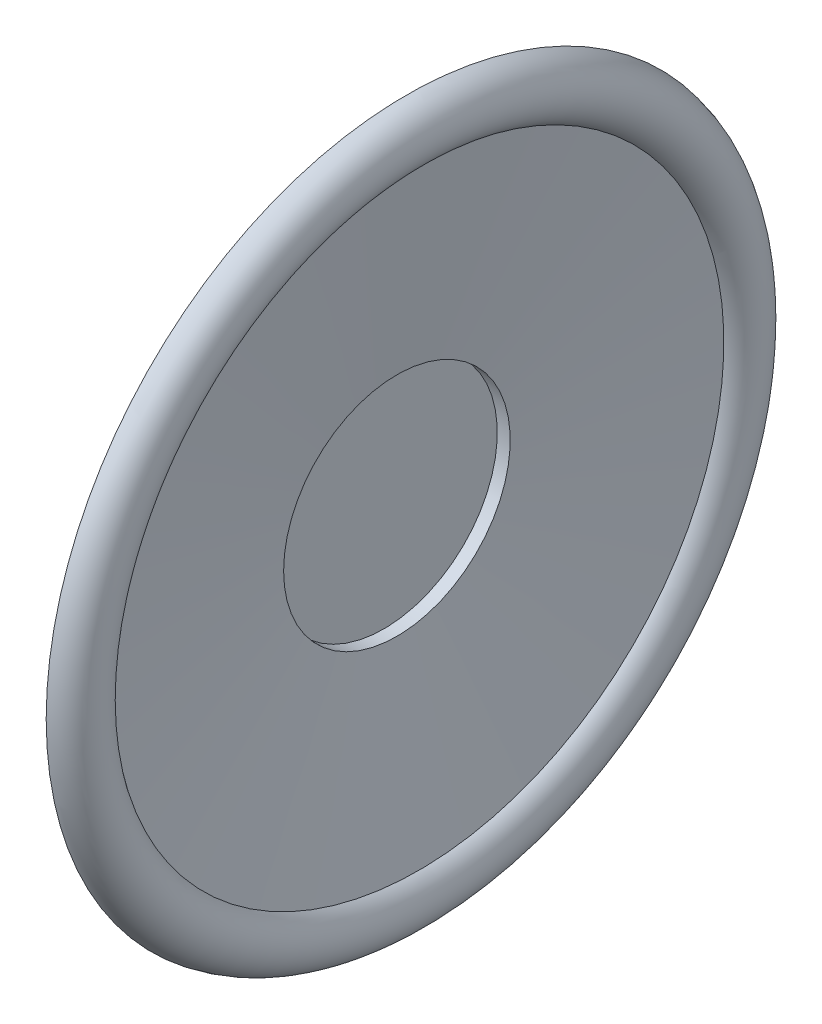
ISO-10303-21;
HEADER;
FILE_DESCRIPTION(('STEP AP214'),'2;1');
FILE_NAME('part.step','',(''),(''),'','','');
FILE_SCHEMA(('AUTOMOTIVE_DESIGN { 1 0 10303 214 1 1 1 1 }'));
ENDSEC;
DATA;
#1=APPLICATION_CONTEXT('core data for automotive mechanical design processes');
#2=APPLICATION_PROTOCOL_DEFINITION('international standard','automotive_design',2000,#1);
#3=PRODUCT_CONTEXT('',#1,'mechanical');
#4=PRODUCT('Part','Part','',(#3));
#5=PRODUCT_RELATED_PRODUCT_CATEGORY('part','',(#4));
#6=PRODUCT_DEFINITION_FORMATION('','',#4);
#7=PRODUCT_DEFINITION_CONTEXT('part definition',#1,'design');
#8=PRODUCT_DEFINITION('design','',#6,#7);
#9=PRODUCT_DEFINITION_SHAPE('','',#8);
#10=(LENGTH_UNIT() NAMED_UNIT(*) SI_UNIT(.MILLI.,.METRE.));
#11=(NAMED_UNIT(*) PLANE_ANGLE_UNIT() SI_UNIT($,.RADIAN.));
#12=(NAMED_UNIT(*) SI_UNIT($,.STERADIAN.) SOLID_ANGLE_UNIT());
#13=UNCERTAINTY_MEASURE_WITH_UNIT(LENGTH_MEASURE(1.E-05),#10,'distance_accuracy_value','');
#14=(GEOMETRIC_REPRESENTATION_CONTEXT(3) GLOBAL_UNCERTAINTY_ASSIGNED_CONTEXT((#13)) GLOBAL_UNIT_ASSIGNED_CONTEXT((#10,
#11,#12)) REPRESENTATION_CONTEXT('',''));
#15=CARTESIAN_POINT('',(0.,0.,0.));
#16=DIRECTION('',(0.,0.,1.));
#17=DIRECTION('',(1.,0.,0.));
#18=AXIS2_PLACEMENT_3D('',#15,#16,#17);
#19=CARTESIAN_POINT('',(1.21052128690283,0.,7.));
#20=DIRECTION('',(-1.,0.,0.));
#21=DIRECTION('',(0.,0.,1.));
#22=AXIS2_PLACEMENT_3D('',#19,#20,#21);
#23=TOROIDAL_SURFACE('',#22,17.4911844864912,1.59453908292243);
#24=CARTESIAN_POINT('',(1.39329390693024,0.,7.));
#25=DIRECTION('',(-1.,0.,0.));
#26=DIRECTION('',(0.,0.,1.));
#27=AXIS2_PLACEMENT_3D('',#24,#25,#26);
#28=CIRCLE('',#27,19.0752138600621);
#29=CARTESIAN_POINT('',(1.39329390693024,0.,26.0752138600621));
#30=VERTEX_POINT('',#29);
#31=EDGE_CURVE('E10',#30,#30,#28,.T.);
#32=ORIENTED_EDGE('',*,*,#31,.F.);
#33=EDGE_LOOP('',(#32));
#34=FACE_BOUND('',#33,.T.);
#35=CARTESIAN_POINT('',(2.06156750117769,0.,7.));
#36=DIRECTION('',(-1.,0.,0.));
#37=DIRECTION('',(0.,0.,1.));
#38=AXIS2_PLACEMENT_3D('',#35,#36,#37);
#39=CIRCLE('',#38,16.1427501246717);
#40=CARTESIAN_POINT('',(2.06156750117769,0.,23.1427501246717));
#41=VERTEX_POINT('',#40);
#42=EDGE_CURVE('E61',#41,#41,#39,.T.);
#43=ORIENTED_EDGE('',*,*,#42,.T.);
#44=EDGE_LOOP('',(#43));
#45=FACE_BOUND('',#44,.T.);
#46=ADVANCED_FACE('F33',(#34,#45),#23,.T.);
#47=CARTESIAN_POINT('',(1.27866979894511,0.,7.));
#48=DIRECTION('',(1.,0.,0.));
#49=DIRECTION('',(0.,0.,-1.));
#50=AXIS2_PLACEMENT_3D('',#47,#48,#49);
#51=CONICAL_SURFACE('',#50,18.0818049241909,1.455919721378);
#52=ORIENTED_EDGE('',*,*,#31,.T.);
#53=EDGE_LOOP('',(#52));
#54=FACE_BOUND('',#53,.T.);
#55=CARTESIAN_POINT('',(1.27866979894511,0.,7.));
#56=DIRECTION('',(-1.,0.,0.));
#57=DIRECTION('',(0.,0.,1.));
#58=AXIS2_PLACEMENT_3D('',#55,#56,#57);
#59=CIRCLE('',#58,18.0818049241909);
#60=CARTESIAN_POINT('',(1.27866979894511,0.,25.0818049241909));
#61=VERTEX_POINT('',#60);
#62=EDGE_CURVE('E39',#61,#61,#59,.T.);
#63=ORIENTED_EDGE('',*,*,#62,.F.);
#64=EDGE_LOOP('',(#63));
#65=FACE_BOUND('',#64,.T.);
#66=ADVANCED_FACE('F89',(#54,#65),#51,.T.);
#67=CARTESIAN_POINT('',(1.21052128690283,0.,7.));
#68=DIRECTION('',(-1.,0.,0.));
#69=DIRECTION('',(0.,0.,1.));
#70=AXIS2_PLACEMENT_3D('',#67,#68,#69);
#71=TOROIDAL_SURFACE('',#70,17.4911844864912,0.594539082922428);
#72=ORIENTED_EDGE('',*,*,#62,.T.);
#73=EDGE_LOOP('',(#72));
#74=FACE_BOUND('',#73,.T.);
#75=CARTESIAN_POINT('',(1.14237277486055,0.,7.));
#76=DIRECTION('',(-1.,0.,0.));
#77=DIRECTION('',(0.,0.,1.));
#78=AXIS2_PLACEMENT_3D('',#75,#76,#77);
#79=CIRCLE('',#78,16.9005640487914);
#80=CARTESIAN_POINT('',(1.14237277486055,0.,23.9005640487914));
#81=VERTEX_POINT('',#80);
#82=EDGE_CURVE('E43',#81,#81,#79,.T.);
#83=ORIENTED_EDGE('',*,*,#82,.F.);
#84=EDGE_LOOP('',(#83));
#85=FACE_BOUND('',#84,.T.);
#86=ADVANCED_FACE('F94',(#74,#85),#71,.F.);
#87=CARTESIAN_POINT('',(0.,0.,7.));
#88=DIRECTION('',(1.,0.,0.));
#89=DIRECTION('',(0.,0.,-1.));
#90=AXIS2_PLACEMENT_3D('',#87,#88,#89);
#91=CONICAL_SURFACE('',#90,7.,1.455919721378);
#92=ORIENTED_EDGE('',*,*,#82,.T.);
#93=EDGE_LOOP('',(#92));
#94=FACE_BOUND('',#93,.T.);
#95=CARTESIAN_POINT('',(0.,0.,7.));
#96=DIRECTION('',(-1.,0.,0.));
#97=DIRECTION('',(0.,0.,1.));
#98=AXIS2_PLACEMENT_3D('',#95,#96,#97);
#99=CIRCLE('',#98,7.);
#100=CARTESIAN_POINT('',(0.,0.,14.));
#101=VERTEX_POINT('',#100);
#102=EDGE_CURVE('E47',#101,#101,#99,.T.);
#103=ORIENTED_EDGE('',*,*,#102,.F.);
#104=EDGE_LOOP('',(#103));
#105=FACE_BOUND('',#104,.T.);
#106=ADVANCED_FACE('F98',(#94,#105),#91,.T.);
#107=CARTESIAN_POINT('',(-0.794424496718019,0.,7.));
#108=DIRECTION('',(-1.,0.,0.));
#109=DIRECTION('',(0.,0.,1.));
#110=AXIS2_PLACEMENT_3D('',#107,#108,#109);
#111=CYLINDRICAL_SURFACE('',#110,7.);
#112=ORIENTED_EDGE('',*,*,#102,.T.);
#113=EDGE_LOOP('',(#112));
#114=FACE_BOUND('',#113,.T.);
#115=CARTESIAN_POINT('',(-0.79442449671802,0.,7.));
#116=DIRECTION('',(-1.,0.,0.));
#117=DIRECTION('',(0.,0.,1.));
#118=AXIS2_PLACEMENT_3D('',#115,#116,#117);
#119=CIRCLE('',#118,7.);
#120=CARTESIAN_POINT('',(-0.79442449671802,0.,14.));
#121=VERTEX_POINT('',#120);
#122=EDGE_CURVE('E52',#121,#121,#119,.T.);
#123=ORIENTED_EDGE('',*,*,#122,.F.);
#124=EDGE_LOOP('',(#123));
#125=FACE_BOUND('',#124,.T.);
#126=ADVANCED_FACE('F85',(#114,#125),#111,.T.);
#127=CARTESIAN_POINT('',(-0.79442449671802,0.,0.));
#128=DIRECTION('',(-1.,0.,0.));
#129=DIRECTION('',(0.,0.,1.));
#130=AXIS2_PLACEMENT_3D('',#127,#128,#129);
#131=PLANE('',#130);
#132=ORIENTED_EDGE('',*,*,#122,.T.);
#133=EDGE_LOOP('',(#132));
#134=FACE_BOUND('',#133,.T.);
#135=ADVANCED_FACE('F80',(#134),#131,.T.);
#136=CARTESIAN_POINT('',(0.20557550328198,0.,0.));
#137=DIRECTION('',(-1.,0.,0.));
#138=DIRECTION('',(0.,0.,1.));
#139=AXIS2_PLACEMENT_3D('',#136,#137,#138);
#140=PLANE('',#139);
#141=CARTESIAN_POINT('',(0.20557550328198,0.,7.));
#142=DIRECTION('',(-1.,0.,0.));
#143=DIRECTION('',(0.,0.,1.));
#144=AXIS2_PLACEMENT_3D('',#141,#142,#143);
#145=CIRCLE('',#144,6.);
#146=CARTESIAN_POINT('',(0.20557550328198,0.,13.));
#147=VERTEX_POINT('',#146);
#148=EDGE_CURVE('E55',#147,#147,#145,.T.);
#149=ORIENTED_EDGE('',*,*,#148,.F.);
#150=EDGE_LOOP('',(#149));
#151=FACE_BOUND('',#150,.T.);
#152=ADVANCED_FACE('F75',(#151),#140,.F.);
#153=CARTESIAN_POINT('',(-0.794424496718019,0.,7.));
#154=DIRECTION('',(-1.,0.,0.));
#155=DIRECTION('',(0.,0.,1.));
#156=AXIS2_PLACEMENT_3D('',#153,#154,#155);
#157=CYLINDRICAL_SURFACE('',#156,6.);
#158=CARTESIAN_POINT('',(0.891250179100185,0.,7.));
#159=DIRECTION('',(-1.,0.,0.));
#160=DIRECTION('',(0.,0.,1.));
#161=AXIS2_PLACEMENT_3D('',#158,#159,#160);
#162=CIRCLE('',#161,6.);
#163=CARTESIAN_POINT('',(0.891250179100185,0.,13.));
#164=VERTEX_POINT('',#163);
#165=EDGE_CURVE('E58',#164,#164,#162,.T.);
#166=ORIENTED_EDGE('',*,*,#165,.F.);
#167=EDGE_LOOP('',(#166));
#168=FACE_BOUND('',#167,.T.);
#169=ORIENTED_EDGE('',*,*,#148,.T.);
#170=EDGE_LOOP('',(#169));
#171=FACE_BOUND('',#170,.T.);
#172=ADVANCED_FACE('F69',(#168,#171),#157,.F.);
#173=CARTESIAN_POINT('',(0.891250179100185,0.,7.));
#174=DIRECTION('',(1.,0.,0.));
#175=DIRECTION('',(0.,0.,-1.));
#176=AXIS2_PLACEMENT_3D('',#173,#174,#175);
#177=CONICAL_SURFACE('',#176,6.,1.455919721378);
#178=ORIENTED_EDGE('',*,*,#42,.F.);
#179=EDGE_LOOP('',(#178));
#180=FACE_BOUND('',#179,.T.);
#181=ORIENTED_EDGE('',*,*,#165,.T.);
#182=EDGE_LOOP('',(#181));
#183=FACE_BOUND('',#182,.T.);
#184=ADVANCED_FACE('F66',(#180,#183),#177,.F.);
#185=CLOSED_SHELL('',(#46,#66,#86,#106,#126,#135,#152,#172,#184));
#186=MANIFOLD_SOLID_BREP('B2',#185);
#187=ADVANCED_BREP_SHAPE_REPRESENTATION('',(#18,#186),#14);
#188=SHAPE_DEFINITION_REPRESENTATION(#9,#187);
ENDSEC;
END-ISO-10303-21;
